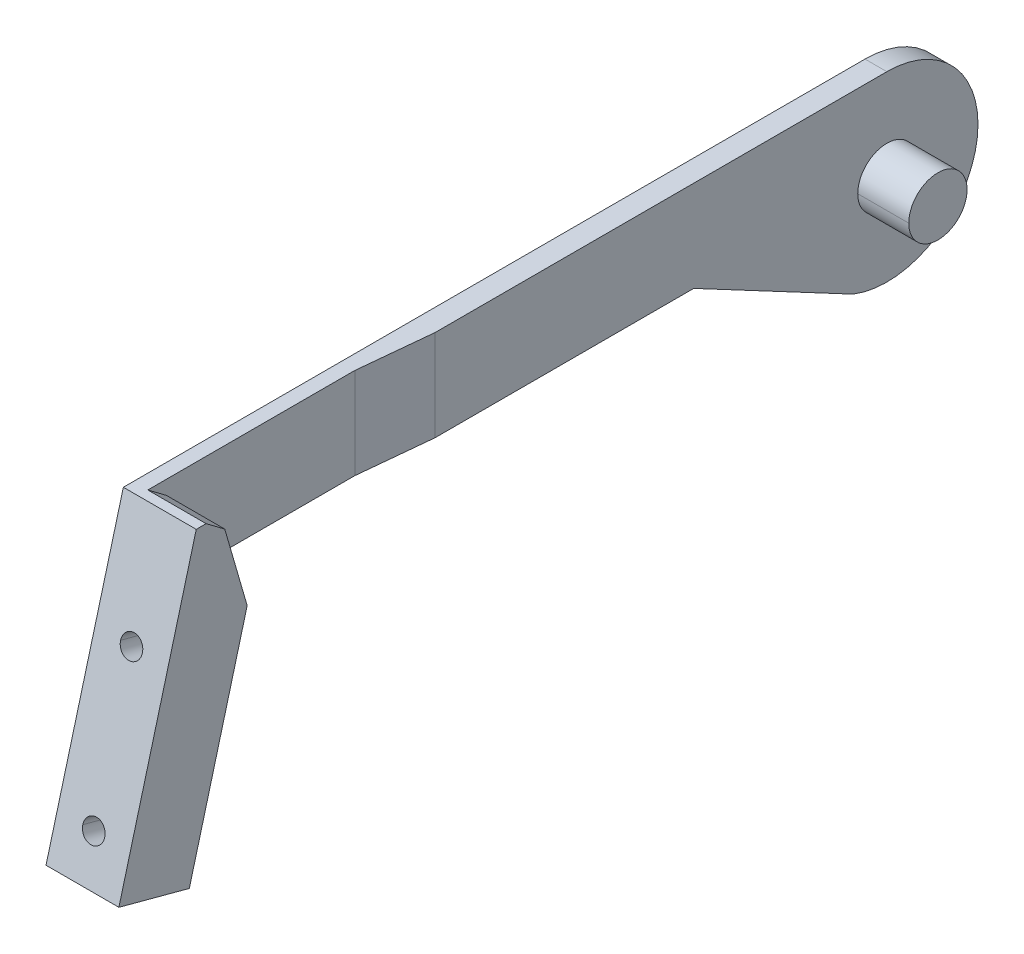
ISO-10303-21;
HEADER;
FILE_DESCRIPTION(('STEP AP214'),'2;1');
FILE_NAME('part.step','',(''),(''),'','','');
FILE_SCHEMA(('AUTOMOTIVE_DESIGN { 1 0 10303 214 1 1 1 1 }'));
ENDSEC;
DATA;
#1=APPLICATION_CONTEXT('core data for automotive mechanical design processes');
#2=APPLICATION_PROTOCOL_DEFINITION('international standard','automotive_design',2000,#1);
#3=PRODUCT_CONTEXT('',#1,'mechanical');
#4=PRODUCT('Part','Part','',(#3));
#5=PRODUCT_RELATED_PRODUCT_CATEGORY('part','',(#4));
#6=PRODUCT_DEFINITION_FORMATION('','',#4);
#7=PRODUCT_DEFINITION_CONTEXT('part definition',#1,'design');
#8=PRODUCT_DEFINITION('design','',#6,#7);
#9=PRODUCT_DEFINITION_SHAPE('','',#8);
#10=(LENGTH_UNIT() NAMED_UNIT(*) SI_UNIT(.MILLI.,.METRE.));
#11=(NAMED_UNIT(*) PLANE_ANGLE_UNIT() SI_UNIT($,.RADIAN.));
#12=(NAMED_UNIT(*) SI_UNIT($,.STERADIAN.) SOLID_ANGLE_UNIT());
#13=UNCERTAINTY_MEASURE_WITH_UNIT(LENGTH_MEASURE(1.E-05),#10,'distance_accuracy_value','');
#14=(GEOMETRIC_REPRESENTATION_CONTEXT(3) GLOBAL_UNCERTAINTY_ASSIGNED_CONTEXT((#13)) GLOBAL_UNIT_ASSIGNED_CONTEXT((#10,
#11,#12)) REPRESENTATION_CONTEXT('',''));
#15=CARTESIAN_POINT('',(0.,0.,0.));
#16=DIRECTION('',(0.,0.,1.));
#17=DIRECTION('',(1.,0.,0.));
#18=AXIS2_PLACEMENT_3D('',#15,#16,#17);
#19=CARTESIAN_POINT('',(-112.386906433293,211.674019092096,35.7842141653933));
#20=DIRECTION('',(-1.,0.,0.));
#21=DIRECTION('',(0.,0.,1.));
#22=AXIS2_PLACEMENT_3D('',#19,#20,#21);
#23=CYLINDRICAL_SURFACE('',#22,4.);
#24=CARTESIAN_POINT('',(-112.386906433293,211.674019092096,35.7842141653933));
#25=DIRECTION('',(1.,0.,0.));
#26=DIRECTION('',(0.,0.,-1.));
#27=AXIS2_PLACEMENT_3D('',#24,#25,#26);
#28=CIRCLE('',#27,4.);
#29=CARTESIAN_POINT('',(-112.386906433293,211.674019092096,31.7842141653933));
#30=VERTEX_POINT('',#29);
#31=CARTESIAN_POINT('',(-112.386906433293,211.674019092096,39.7842141653933));
#32=VERTEX_POINT('',#31);
#33=EDGE_CURVE('E276',#30,#32,#28,.T.);
#34=ORIENTED_EDGE('',*,*,#33,.F.);
#35=DIRECTION('',(-1.,0.,0.));
#36=VECTOR('',#35,1.);
#37=CARTESIAN_POINT('',(-112.386906433293,211.674019092096,31.7842141653933));
#38=LINE('',#37,#36);
#39=CARTESIAN_POINT('',(-119.386906433293,211.674019092096,31.7842141653934));
#40=VERTEX_POINT('',#39);
#41=EDGE_CURVE('E465',#30,#40,#38,.T.);
#42=ORIENTED_EDGE('',*,*,#41,.T.);
#43=CARTESIAN_POINT('',(-119.386906433293,211.674019092096,35.7842141653934));
#44=DIRECTION('',(1.,0.,0.));
#45=DIRECTION('',(0.,0.,-1.));
#46=AXIS2_PLACEMENT_3D('',#43,#44,#45);
#47=CIRCLE('',#46,4.);
#48=CARTESIAN_POINT('',(-119.386906433293,211.674019092096,39.7842141653934));
#49=VERTEX_POINT('',#48);
#50=EDGE_CURVE('E231',#40,#49,#47,.T.);
#51=ORIENTED_EDGE('',*,*,#50,.T.);
#52=DIRECTION('',(-1.,0.,0.));
#53=VECTOR('',#52,1.);
#54=CARTESIAN_POINT('',(-112.386906433293,211.674019092096,39.7842141653933));
#55=LINE('',#54,#53);
#56=EDGE_CURVE('E216',#32,#49,#55,.T.);
#57=ORIENTED_EDGE('',*,*,#56,.F.);
#58=EDGE_LOOP('',(#34,#42,#51,#57));
#59=FACE_BOUND('',#58,.T.);
#60=ADVANCED_FACE('F15',(#59),#23,.T.);
#61=CARTESIAN_POINT('',(-117.386906433294,209.685131697759,141.412633759828));
#62=DIRECTION('',(0.,-0.258819045102503,-0.965925826289073));
#63=DIRECTION('',(1.,0.,0.));
#64=AXIS2_PLACEMENT_3D('',#61,#62,#63);
#65=CYLINDRICAL_SURFACE('',#64,1.5);
#66=CARTESIAN_POINT('',(-117.386906433294,209.685131697759,141.412633759828));
#67=DIRECTION('',(0.,-0.258819045102506,-0.965925826289072));
#68=DIRECTION('',(1.,0.,0.));
#69=AXIS2_PLACEMENT_3D('',#66,#67,#68);
#70=CIRCLE('',#69,1.5);
#71=CARTESIAN_POINT('',(-118.886906433294,209.685131697759,141.412633759828));
#72=VERTEX_POINT('',#71);
#73=CARTESIAN_POINT('',(-115.886906433294,209.685131697759,141.412633759828));
#74=VERTEX_POINT('',#73);
#75=EDGE_CURVE('E255',#72,#74,#70,.T.);
#76=ORIENTED_EDGE('',*,*,#75,.F.);
#77=DIRECTION('',(0.,-0.258819045102503,-0.965925826289073));
#78=VECTOR('',#77,1.);
#79=CARTESIAN_POINT('',(-118.886906433294,209.685131697759,141.412633759828));
#80=LINE('',#79,#78);
#81=CARTESIAN_POINT('',(-118.886906433294,207.096941246734,131.753375496936));
#82=VERTEX_POINT('',#81);
#83=EDGE_CURVE('E187',#72,#82,#80,.T.);
#84=ORIENTED_EDGE('',*,*,#83,.T.);
#85=CARTESIAN_POINT('',(-117.386906433294,207.096941246734,131.753375496936));
#86=DIRECTION('',(0.,0.258819045102553,0.96592582628906));
#87=DIRECTION('',(1.,0.,0.));
#88=AXIS2_PLACEMENT_3D('',#85,#86,#87);
#89=CIRCLE('',#88,1.5);
#90=CARTESIAN_POINT('',(-115.886906433294,207.096941246734,131.753375496936));
#91=VERTEX_POINT('',#90);
#92=EDGE_CURVE('E238',#91,#82,#89,.T.);
#93=ORIENTED_EDGE('',*,*,#92,.F.);
#94=DIRECTION('',(0.,-0.258819045102503,-0.965925826289073));
#95=VECTOR('',#94,1.);
#96=CARTESIAN_POINT('',(-115.886906433294,209.685131697759,141.412633759828));
#97=LINE('',#96,#95);
#98=EDGE_CURVE('E299',#74,#91,#97,.T.);
#99=ORIENTED_EDGE('',*,*,#98,.F.);
#100=EDGE_LOOP('',(#76,#84,#93,#99));
#101=FACE_BOUND('',#100,.T.);
#102=ADVANCED_FACE('F396',(#101),#65,.F.);
#103=CARTESIAN_POINT('',(-117.386906433293,190.366615171978,146.589014661879));
#104=DIRECTION('',(0.,-0.258819045102503,-0.965925826289073));
#105=DIRECTION('',(1.,0.,0.));
#106=AXIS2_PLACEMENT_3D('',#103,#104,#105);
#107=CYLINDRICAL_SURFACE('',#106,1.5);
#108=CARTESIAN_POINT('',(-117.386906433293,190.366615171978,146.589014661878));
#109=DIRECTION('',(0.,-0.258819045102506,-0.965925826289072));
#110=DIRECTION('',(1.,0.,0.));
#111=AXIS2_PLACEMENT_3D('',#108,#109,#110);
#112=CIRCLE('',#111,1.5);
#113=CARTESIAN_POINT('',(-118.886906433293,190.366615171978,146.589014661878));
#114=VERTEX_POINT('',#113);
#115=CARTESIAN_POINT('',(-115.886906433293,190.366615171978,146.589014661878));
#116=VERTEX_POINT('',#115);
#117=EDGE_CURVE('E256',#114,#116,#112,.T.);
#118=ORIENTED_EDGE('',*,*,#117,.F.);
#119=DIRECTION('',(0.,-0.258819045102503,-0.965925826289073));
#120=VECTOR('',#119,1.);
#121=CARTESIAN_POINT('',(-118.886906433293,190.366615171978,146.589014661879));
#122=LINE('',#121,#120);
#123=CARTESIAN_POINT('',(-118.886906433293,187.778424720953,136.929756398986));
#124=VERTEX_POINT('',#123);
#125=EDGE_CURVE('E266',#114,#124,#122,.T.);
#126=ORIENTED_EDGE('',*,*,#125,.T.);
#127=CARTESIAN_POINT('',(-117.386906433293,187.778424720952,136.929756398986));
#128=DIRECTION('',(0.,0.258819045102553,0.96592582628906));
#129=DIRECTION('',(1.,0.,0.));
#130=AXIS2_PLACEMENT_3D('',#127,#128,#129);
#131=CIRCLE('',#130,1.5);
#132=CARTESIAN_POINT('',(-115.886906433293,187.778424720953,136.929756398986));
#133=VERTEX_POINT('',#132);
#134=EDGE_CURVE('E244',#133,#124,#131,.T.);
#135=ORIENTED_EDGE('',*,*,#134,.F.);
#136=DIRECTION('',(0.,-0.258819045102503,-0.965925826289073));
#137=VECTOR('',#136,1.);
#138=CARTESIAN_POINT('',(-115.886906433293,190.366615171978,146.589014661879));
#139=LINE('',#138,#137);
#140=EDGE_CURVE('E261',#116,#133,#139,.T.);
#141=ORIENTED_EDGE('',*,*,#140,.F.);
#142=EDGE_LOOP('',(#118,#126,#135,#141));
#143=FACE_BOUND('',#142,.T.);
#144=ADVANCED_FACE('F377',(#143),#107,.F.);
#145=CARTESIAN_POINT('',(-119.386906433293,211.674019092097,35.784214165394));
#146=DIRECTION('',(-1.,0.,0.));
#147=DIRECTION('',(0.,0.,-1.));
#148=AXIS2_PLACEMENT_3D('',#145,#146,#147);
#149=CYLINDRICAL_SURFACE('',#148,12.5);
#150=CARTESIAN_POINT('',(-119.386906433293,211.674019092097,35.784214165394));
#151=DIRECTION('',(1.,0.,0.));
#152=DIRECTION('',(0.,0.,-1.));
#153=AXIS2_PLACEMENT_3D('',#150,#151,#152);
#154=CIRCLE('',#153,12.5);
#155=CARTESIAN_POINT('',(-119.386906433293,211.674019092097,23.284214165394));
#156=VERTEX_POINT('',#155);
#157=CARTESIAN_POINT('',(-119.386906433293,224.174019092097,35.7842141653937));
#158=VERTEX_POINT('',#157);
#159=EDGE_CURVE('E234',#156,#158,#154,.T.);
#160=ORIENTED_EDGE('',*,*,#159,.F.);
#161=DIRECTION('',(-1.,0.,0.));
#162=VECTOR('',#161,1.);
#163=CARTESIAN_POINT('',(-119.386906433293,211.674019092097,23.284214165394));
#164=LINE('',#163,#162);
#165=CARTESIAN_POINT('',(-122.386906433293,211.674019092097,23.2842141653941));
#166=VERTEX_POINT('',#165);
#167=EDGE_CURVE('E9',#156,#166,#164,.T.);
#168=ORIENTED_EDGE('',*,*,#167,.T.);
#169=CARTESIAN_POINT('',(-122.386906433293,211.674019092097,35.7842141653941));
#170=DIRECTION('',(1.,0.,0.));
#171=DIRECTION('',(0.,0.,-1.));
#172=AXIS2_PLACEMENT_3D('',#169,#170,#171);
#173=CIRCLE('',#172,12.5);
#174=CARTESIAN_POINT('',(-122.386906433293,224.174019092097,35.7842141653938));
#175=VERTEX_POINT('',#174);
#176=EDGE_CURVE('E321',#166,#175,#173,.T.);
#177=ORIENTED_EDGE('',*,*,#176,.T.);
#178=DIRECTION('',(-1.,0.,0.));
#179=VECTOR('',#178,1.);
#180=CARTESIAN_POINT('',(-119.386906433293,224.174019092097,35.7842141653937));
#181=LINE('',#180,#179);
#182=EDGE_CURVE('E249',#158,#175,#181,.T.);
#183=ORIENTED_EDGE('',*,*,#182,.F.);
#184=EDGE_LOOP('',(#160,#168,#177,#183));
#185=FACE_BOUND('',#184,.T.);
#186=ADVANCED_FACE('F651',(#185),#149,.T.);
#187=CARTESIAN_POINT('',(-119.386906433293,211.674019092097,35.784214165394));
#188=DIRECTION('',(-1.,0.,0.));
#189=DIRECTION('',(0.,0.,-1.));
#190=AXIS2_PLACEMENT_3D('',#187,#188,#189);
#191=CYLINDRICAL_SURFACE('',#190,12.5);
#192=ORIENTED_EDGE('',*,*,#167,.F.);
#193=CARTESIAN_POINT('',(-119.386906433293,211.674019092097,35.784214165394));
#194=DIRECTION('',(1.,0.,0.));
#195=DIRECTION('',(0.,0.,-1.));
#196=AXIS2_PLACEMENT_3D('',#193,#194,#195);
#197=CIRCLE('',#196,12.5);
#198=CARTESIAN_POINT('',(-119.386906433293,200.075122592861,40.4442141653944));
#199=VERTEX_POINT('',#198);
#200=EDGE_CURVE('E477',#199,#156,#197,.T.);
#201=ORIENTED_EDGE('',*,*,#200,.F.);
#202=DIRECTION('',(1.,0.,0.));
#203=VECTOR('',#202,1.);
#204=CARTESIAN_POINT('',(-119.386906433293,200.075122592861,40.4442141653944));
#205=LINE('',#204,#203);
#206=CARTESIAN_POINT('',(-122.386906433293,200.075122592861,40.4442141653944));
#207=VERTEX_POINT('',#206);
#208=EDGE_CURVE('E26',#207,#199,#205,.T.);
#209=ORIENTED_EDGE('',*,*,#208,.F.);
#210=CARTESIAN_POINT('',(-122.386906433293,211.674019092097,35.7842141653941));
#211=DIRECTION('',(1.,0.,0.));
#212=DIRECTION('',(0.,0.,-1.));
#213=AXIS2_PLACEMENT_3D('',#210,#211,#212);
#214=CIRCLE('',#213,12.5);
#215=EDGE_CURVE('E283',#207,#166,#214,.T.);
#216=ORIENTED_EDGE('',*,*,#215,.T.);
#217=EDGE_LOOP('',(#192,#201,#209,#216));
#218=FACE_BOUND('',#217,.T.);
#219=ADVANCED_FACE('F414',(#218),#191,.T.);
#220=CARTESIAN_POINT('',(-119.386906433293,205.874570842479,51.3642141653942));
#221=DIRECTION('',(0.,-0.883176086632772,0.469041575982366));
#222=DIRECTION('',(-1.,0.,0.));
#223=AXIS2_PLACEMENT_3D('',#220,#221,#222);
#224=PLANE('',#223);
#225=DIRECTION('',(0.,-0.469041575982366,-0.883176086632772));
#226=VECTOR('',#225,1.);
#227=CARTESIAN_POINT('',(-122.386906433293,213.382785094218,65.501714165394));
#228=LINE('',#227,#226);
#229=CARTESIAN_POINT('',(-122.386906433293,211.674019092098,62.2842141653941));
#230=VERTEX_POINT('',#229);
#231=EDGE_CURVE('E279',#230,#207,#228,.T.);
#232=ORIENTED_EDGE('',*,*,#231,.T.);
#233=ORIENTED_EDGE('',*,*,#208,.T.);
#234=DIRECTION('',(0.,0.469041575982366,0.883176086632772));
#235=VECTOR('',#234,1.);
#236=CARTESIAN_POINT('',(-119.386906433293,213.382785094217,65.501714165394));
#237=LINE('',#236,#235);
#238=CARTESIAN_POINT('',(-119.386906433293,211.674019092098,62.284214165394));
#239=VERTEX_POINT('',#238);
#240=EDGE_CURVE('E19',#199,#239,#237,.T.);
#241=ORIENTED_EDGE('',*,*,#240,.T.);
#242=DIRECTION('',(-1.,0.,0.));
#243=VECTOR('',#242,1.);
#244=CARTESIAN_POINT('',(-119.386906433293,211.674019092098,62.284214165394));
#245=LINE('',#244,#243);
#246=EDGE_CURVE('E292',#239,#230,#245,.T.);
#247=ORIENTED_EDGE('',*,*,#246,.T.);
#248=EDGE_LOOP('',(#232,#233,#241,#247));
#249=FACE_BOUND('',#248,.T.);
#250=ADVANCED_FACE('F410',(#249),#224,.T.);
#251=CARTESIAN_POINT('',(-119.386906433292,211.674019092098,84.5342141653941));
#252=DIRECTION('',(1.,0.,0.));
#253=DIRECTION('',(0.,0.,-1.));
#254=AXIS2_PLACEMENT_3D('',#251,#252,#253);
#255=PLANE('',#254);
#256=CARTESIAN_POINT('',(-119.386906433293,211.674019092096,35.7842141653934));
#257=DIRECTION('',(1.,0.,0.));
#258=DIRECTION('',(0.,0.,-1.));
#259=AXIS2_PLACEMENT_3D('',#256,#257,#258);
#260=CIRCLE('',#259,4.);
#261=EDGE_CURVE('E218',#49,#40,#260,.T.);
#262=ORIENTED_EDGE('',*,*,#261,.F.);
#263=ORIENTED_EDGE('',*,*,#50,.F.);
#264=EDGE_LOOP('',(#262,#263));
#265=FACE_BOUND('',#264,.T.);
#266=DIRECTION('',(0.,0.,-1.));
#267=VECTOR('',#266,1.);
#268=CARTESIAN_POINT('',(-119.386906433291,211.6740190921,145.784214165394));
#269=LINE('',#268,#267);
#270=CARTESIAN_POINT('',(-119.386906433292,211.674019092099,97.7842141653975));
#271=VERTEX_POINT('',#270);
#272=EDGE_CURVE('E295',#271,#239,#269,.T.);
#273=ORIENTED_EDGE('',*,*,#272,.T.);
#274=ORIENTED_EDGE('',*,*,#240,.F.);
#275=ORIENTED_EDGE('',*,*,#200,.T.);
#276=ORIENTED_EDGE('',*,*,#159,.T.);
#277=DIRECTION('',(0.,0.,1.));
#278=VECTOR('',#277,1.);
#279=CARTESIAN_POINT('',(-119.386906433293,224.174019092097,25.7842141653937));
#280=LINE('',#279,#278);
#281=CARTESIAN_POINT('',(-119.386906433292,224.174019092099,97.7842141653971));
#282=VERTEX_POINT('',#281);
#283=EDGE_CURVE('E245',#158,#282,#280,.T.);
#284=ORIENTED_EDGE('',*,*,#283,.T.);
#285=DIRECTION('',(0.,1.,0.));
#286=VECTOR('',#285,1.);
#287=CARTESIAN_POINT('',(-119.386906433292,217.924019092098,97.7842141653973));
#288=LINE('',#287,#286);
#289=EDGE_CURVE('E284',#271,#282,#288,.T.);
#290=ORIENTED_EDGE('',*,*,#289,.F.);
#291=EDGE_LOOP('',(#273,#274,#275,#276,#284,#290));
#292=FACE_BOUND('',#291,.T.);
#293=ADVANCED_FACE('F413',(#265,#292),#255,.T.);
#294=CARTESIAN_POINT('',(-119.886906433292,217.924019092098,102.784214165397));
#295=DIRECTION('',(0.995037190209991,0.,0.099503719020983));
#296=DIRECTION('',(0.,-1.,0.));
#297=AXIS2_PLACEMENT_3D('',#294,#295,#296);
#298=PLANE('',#297);
#299=DIRECTION('',(0.0995037190209828,0.,-0.995037190209991));
#300=VECTOR('',#299,1.);
#301=CARTESIAN_POINT('',(-116.691361878837,211.674019092098,70.8287686208413));
#302=LINE('',#301,#300);
#303=CARTESIAN_POINT('',(-120.386906433293,211.674019092098,107.784214165398));
#304=VERTEX_POINT('',#303);
#305=EDGE_CURVE('E287',#304,#271,#302,.T.);
#306=ORIENTED_EDGE('',*,*,#305,.T.);
#307=ORIENTED_EDGE('',*,*,#289,.T.);
#308=DIRECTION('',(-0.0995037190209828,0.,0.995037190209991));
#309=VECTOR('',#308,1.);
#310=CARTESIAN_POINT('',(-121.518094552103,224.174019092099,119.096095353514));
#311=LINE('',#310,#309);
#312=CARTESIAN_POINT('',(-120.386906433293,224.174019092097,107.784214165397));
#313=VERTEX_POINT('',#312);
#314=EDGE_CURVE('E250',#282,#313,#311,.T.);
#315=ORIENTED_EDGE('',*,*,#314,.T.);
#316=DIRECTION('',(0.,-1.,0.));
#317=VECTOR('',#316,1.);
#318=CARTESIAN_POINT('',(-120.386906433293,224.174019092097,107.784214165397));
#319=LINE('',#318,#317);
#320=EDGE_CURVE('E243',#313,#304,#319,.T.);
#321=ORIENTED_EDGE('',*,*,#320,.T.);
#322=EDGE_LOOP('',(#306,#307,#315,#321));
#323=FACE_BOUND('',#322,.T.);
#324=ADVANCED_FACE('F426',(#323),#298,.T.);
#325=CARTESIAN_POINT('',(-119.386906433293,211.674019092097,48.284214165394));
#326=DIRECTION('',(0.,-1.,0.));
#327=DIRECTION('',(-1.,0.,0.));
#328=AXIS2_PLACEMENT_3D('',#325,#326,#327);
#329=PLANE('',#328);
#330=DIRECTION('',(0.,0.,-1.));
#331=VECTOR('',#330,1.);
#332=CARTESIAN_POINT('',(-122.386906433293,211.674019092098,66.4092141653941));
#333=LINE('',#332,#331);
#334=CARTESIAN_POINT('',(-122.386906433292,211.6740190921,130.558746124124));
#335=VERTEX_POINT('',#334);
#336=EDGE_CURVE('E214',#335,#230,#333,.T.);
#337=ORIENTED_EDGE('',*,*,#336,.T.);
#338=ORIENTED_EDGE('',*,*,#246,.F.);
#339=ORIENTED_EDGE('',*,*,#272,.F.);
#340=ORIENTED_EDGE('',*,*,#305,.F.);
#341=DIRECTION('',(0.,0.,1.));
#342=VECTOR('',#341,1.);
#343=CARTESIAN_POINT('',(-120.386906433293,211.674019092098,81.2842141653958));
#344=LINE('',#343,#342);
#345=CARTESIAN_POINT('',(-120.386906433293,211.6740190921,130.558746124124));
#346=VERTEX_POINT('',#345);
#347=EDGE_CURVE('E240',#304,#346,#344,.T.);
#348=ORIENTED_EDGE('',*,*,#347,.T.);
#349=DIRECTION('',(-1.,0.,0.));
#350=VECTOR('',#349,1.);
#351=CARTESIAN_POINT('',(-119.636906433292,211.674019092099,130.558746124124));
#352=LINE('',#351,#350);
#353=EDGE_CURVE('E239',#346,#335,#352,.T.);
#354=ORIENTED_EDGE('',*,*,#353,.T.);
#355=EDGE_LOOP('',(#337,#338,#339,#340,#348,#354));
#356=FACE_BOUND('',#355,.T.);
#357=ADVANCED_FACE('F17',(#356),#329,.T.);
#358=CARTESIAN_POINT('',(-120.386906433293,224.365693501724,124.284214165397));
#359=DIRECTION('',(1.,0.,0.));
#360=DIRECTION('',(0.,0.,-1.));
#361=AXIS2_PLACEMENT_3D('',#358,#359,#360);
#362=PLANE('',#361);
#363=ORIENTED_EDGE('',*,*,#347,.F.);
#364=ORIENTED_EDGE('',*,*,#320,.F.);
#365=DIRECTION('',(0.,0.,-1.));
#366=VECTOR('',#365,1.);
#367=CARTESIAN_POINT('',(-120.386906433293,224.174019092099,130.034214165395));
#368=LINE('',#367,#366);
#369=CARTESIAN_POINT('',(-120.386906433293,224.1740190921,136.177586279186));
#370=VERTEX_POINT('',#369);
#371=EDGE_CURVE('E275',#370,#313,#368,.T.);
#372=ORIENTED_EDGE('',*,*,#371,.F.);
#373=DIRECTION('',(0.,0.600796224988207,0.799402211680653));
#374=VECTOR('',#373,1.);
#375=CARTESIAN_POINT('',(-120.386906433293,220.872272803947,131.784377441681));
#376=LINE('',#375,#374);
#377=CARTESIAN_POINT('',(-120.386906433293,222.252907768,133.621410695026));
#378=VERTEX_POINT('',#377);
#379=EDGE_CURVE('E271',#378,#370,#376,.T.);
#380=ORIENTED_EDGE('',*,*,#379,.F.);
#381=DIRECTION('',(0.,0.960555662049912,0.278087792079865));
#382=VECTOR('',#381,1.);
#383=CARTESIAN_POINT('',(-120.386906433293,219.801833140684,132.911806912275));
#384=LINE('',#383,#382);
#385=EDGE_CURVE('E235',#346,#378,#384,.T.);
#386=ORIENTED_EDGE('',*,*,#385,.F.);
#387=EDGE_LOOP('',(#363,#364,#372,#380,#386));
#388=FACE_BOUND('',#387,.T.);
#389=ADVANCED_FACE('F421',(#388),#362,.T.);
#390=CARTESIAN_POINT('',(-120.386906433295,182.174019092093,138.431452361295));
#391=DIRECTION('',(0.,0.258819045102553,0.96592582628906));
#392=DIRECTION('',(1.,0.,0.));
#393=AXIS2_PLACEMENT_3D('',#390,#391,#392);
#394=PLANE('',#393);
#395=ORIENTED_EDGE('',*,*,#134,.T.);
#396=CARTESIAN_POINT('',(-117.386906433293,187.778424720952,136.929756398986));
#397=DIRECTION('',(0.,0.258819045102553,0.96592582628906));
#398=DIRECTION('',(1.,0.,0.));
#399=AXIS2_PLACEMENT_3D('',#396,#397,#398);
#400=CIRCLE('',#399,1.5);
#401=EDGE_CURVE('E265',#124,#133,#400,.T.);
#402=ORIENTED_EDGE('',*,*,#401,.T.);
#403=EDGE_LOOP('',(#395,#402));
#404=FACE_BOUND('',#403,.T.);
#405=ORIENTED_EDGE('',*,*,#92,.T.);
#406=CARTESIAN_POINT('',(-117.386906433294,207.096941246734,131.753375496936));
#407=DIRECTION('',(0.,0.258819045102553,0.96592582628906));
#408=DIRECTION('',(1.,0.,0.));
#409=AXIS2_PLACEMENT_3D('',#406,#407,#408);
#410=CIRCLE('',#409,1.5);
#411=EDGE_CURVE('E303',#82,#91,#410,.T.);
#412=ORIENTED_EDGE('',*,*,#411,.T.);
#413=EDGE_LOOP('',(#405,#412));
#414=FACE_BOUND('',#413,.T.);
#415=DIRECTION('',(-1.,0.,0.));
#416=VECTOR('',#415,1.);
#417=CARTESIAN_POINT('',(-120.386906433295,181.982869763218,138.482670669601));
#418=LINE('',#417,#416);
#419=CARTESIAN_POINT('',(-112.386906433295,181.982869763218,138.4826706696));
#420=VERTEX_POINT('',#419);
#421=CARTESIAN_POINT('',(-122.386906433292,181.982869763218,138.4826706696));
#422=VERTEX_POINT('',#421);
#423=EDGE_CURVE('E288',#420,#422,#418,.T.);
#424=ORIENTED_EDGE('',*,*,#423,.T.);
#425=DIRECTION('',(0.,-0.96592582628906,0.258819045102553));
#426=VECTOR('',#425,1.);
#427=CARTESIAN_POINT('',(-122.386906433292,202.673111219494,132.938737180186));
#428=LINE('',#427,#426);
#429=CARTESIAN_POINT('',(-122.386906433292,211.616983350338,130.542233865519));
#430=VERTEX_POINT('',#429);
#431=EDGE_CURVE('E229',#430,#422,#428,.T.);
#432=ORIENTED_EDGE('',*,*,#431,.F.);
#433=DIRECTION('',(-1.,0.,0.));
#434=VECTOR('',#433,1.);
#435=CARTESIAN_POINT('',(-119.886906433293,211.616983350338,130.542233865519));
#436=LINE('',#435,#434);
#437=CARTESIAN_POINT('',(-112.386906433294,211.616983350338,130.542233865519));
#438=VERTEX_POINT('',#437);
#439=EDGE_CURVE('E334',#438,#430,#436,.T.);
#440=ORIENTED_EDGE('',*,*,#439,.F.);
#441=DIRECTION('',(0.,-0.965925826289057,0.258819045102562));
#442=VECTOR('',#441,1.);
#443=CARTESIAN_POINT('',(-112.386906433294,186.812498894663,137.188575444087));
#444=LINE('',#443,#442);
#445=EDGE_CURVE('E224',#438,#420,#444,.T.);
#446=ORIENTED_EDGE('',*,*,#445,.T.);
#447=EDGE_LOOP('',(#424,#432,#440,#446));
#448=FACE_BOUND('',#447,.T.);
#449=ADVANCED_FACE('F418',(#404,#414,#448),#394,.F.);
#450=CARTESIAN_POINT('',(-119.886906433293,217.895501221219,132.359910072352));
#451=DIRECTION('',(0.,0.278087792079866,-0.960555662049912));
#452=DIRECTION('',(-1.,0.,0.));
#453=AXIS2_PLACEMENT_3D('',#450,#451,#452);
#454=PLANE('',#453);
#455=DIRECTION('',(-1.,0.,0.));
#456=VECTOR('',#455,1.);
#457=CARTESIAN_POINT('',(-119.636906433292,222.252907768,133.621410695026));
#458=LINE('',#457,#456);
#459=CARTESIAN_POINT('',(-112.386906433294,222.252907768,133.621410695026));
#460=VERTEX_POINT('',#459);
#461=EDGE_CURVE('E267',#460,#378,#458,.T.);
#462=ORIENTED_EDGE('',*,*,#461,.F.);
#463=DIRECTION('',(0.,-0.960555662049912,-0.278087792079865));
#464=VECTOR('',#463,1.);
#465=CARTESIAN_POINT('',(-112.386906433294,212.79535546409,130.883381091347));
#466=LINE('',#465,#464);
#467=EDGE_CURVE('E221',#460,#438,#466,.T.);
#468=ORIENTED_EDGE('',*,*,#467,.T.);
#469=ORIENTED_EDGE('',*,*,#439,.T.);
#470=DIRECTION('',(0.,0.960555662049912,0.278087792079865));
#471=VECTOR('',#470,1.);
#472=CARTESIAN_POINT('',(-122.386906433292,208.637751208657,129.679724673074));
#473=LINE('',#472,#471);
#474=EDGE_CURVE('E226',#430,#335,#473,.T.);
#475=ORIENTED_EDGE('',*,*,#474,.T.);
#476=ORIENTED_EDGE('',*,*,#353,.F.);
#477=ORIENTED_EDGE('',*,*,#385,.T.);
#478=EDGE_LOOP('',(#462,#468,#469,#475,#476,#477));
#479=FACE_BOUND('',#478,.T.);
#480=ADVANCED_FACE('F409',(#479),#454,.T.);
#481=CARTESIAN_POINT('',(-119.386906433291,224.1740190921,145.784214165394));
#482=DIRECTION('',(0.,1.,0.));
#483=DIRECTION('',(0.,0.,-1.));
#484=AXIS2_PLACEMENT_3D('',#481,#482,#483);
#485=PLANE('',#484);
#486=DIRECTION('',(1.,0.,0.));
#487=VECTOR('',#486,1.);
#488=CARTESIAN_POINT('',(-119.636906433292,224.1740190921,136.177586279186));
#489=LINE('',#488,#487);
#490=CARTESIAN_POINT('',(-112.386906433294,224.174019092096,136.177586279186));
#491=VERTEX_POINT('',#490);
#492=EDGE_CURVE('E313',#370,#491,#489,.T.);
#493=ORIENTED_EDGE('',*,*,#492,.F.);
#494=ORIENTED_EDGE('',*,*,#371,.T.);
#495=ORIENTED_EDGE('',*,*,#314,.F.);
#496=ORIENTED_EDGE('',*,*,#283,.F.);
#497=ORIENTED_EDGE('',*,*,#182,.T.);
#498=DIRECTION('',(0.,0.,-1.));
#499=VECTOR('',#498,1.);
#500=CARTESIAN_POINT('',(-122.386906433292,224.174019092093,112.659214165395));
#501=LINE('',#500,#499);
#502=CARTESIAN_POINT('',(-122.386906433291,224.174019092093,137.530348083289));
#503=VERTEX_POINT('',#502);
#504=EDGE_CURVE('E193',#503,#175,#501,.T.);
#505=ORIENTED_EDGE('',*,*,#504,.F.);
#506=DIRECTION('',(1.,0.,0.));
#507=VECTOR('',#506,1.);
#508=CARTESIAN_POINT('',(-120.386906433294,224.174019092097,137.530348083286));
#509=LINE('',#508,#507);
#510=CARTESIAN_POINT('',(-112.386906433294,224.174019092097,137.530348083286));
#511=VERTEX_POINT('',#510);
#512=EDGE_CURVE('E190',#503,#511,#509,.T.);
#513=ORIENTED_EDGE('',*,*,#512,.T.);
#514=DIRECTION('',(0.,1.04649593857805E-13,1.));
#515=VECTOR('',#514,1.);
#516=CARTESIAN_POINT('',(-112.386906433295,224.174019092094,107.784214165399));
#517=LINE('',#516,#515);
#518=EDGE_CURVE('E174',#491,#511,#517,.T.);
#519=ORIENTED_EDGE('',*,*,#518,.F.);
#520=EDGE_LOOP('',(#493,#494,#495,#496,#497,#505,#513,#519));
#521=FACE_BOUND('',#520,.T.);
#522=ADVANCED_FACE('F191',(#521),#485,.T.);
#523=CARTESIAN_POINT('',(-119.636906433292,223.21346343005,134.899498487106));
#524=DIRECTION('',(0.,0.799402211680653,-0.600796224988207));
#525=DIRECTION('',(-1.,0.,0.));
#526=AXIS2_PLACEMENT_3D('',#523,#524,#525);
#527=PLANE('',#526);
#528=DIRECTION('',(0.,-0.600796224988207,-0.799402211680653));
#529=VECTOR('',#528,1.);
#530=CARTESIAN_POINT('',(-112.386906433294,220.522819771925,131.319405267993));
#531=LINE('',#530,#529);
#532=EDGE_CURVE('E183',#491,#460,#531,.T.);
#533=ORIENTED_EDGE('',*,*,#532,.T.);
#534=ORIENTED_EDGE('',*,*,#461,.T.);
#535=ORIENTED_EDGE('',*,*,#379,.T.);
#536=ORIENTED_EDGE('',*,*,#492,.T.);
#537=EDGE_LOOP('',(#533,#534,#535,#536));
#538=FACE_BOUND('',#537,.T.);
#539=ADVANCED_FACE('F351',(#538),#527,.T.);
#540=CARTESIAN_POINT('',(-117.386906433293,190.366615171978,146.589014661879));
#541=DIRECTION('',(0.,-0.258819045102503,-0.965925826289073));
#542=DIRECTION('',(1.,0.,0.));
#543=AXIS2_PLACEMENT_3D('',#540,#541,#542);
#544=CYLINDRICAL_SURFACE('',#543,1.5);
#545=ORIENTED_EDGE('',*,*,#125,.F.);
#546=CARTESIAN_POINT('',(-117.386906433293,190.366615171978,146.589014661878));
#547=DIRECTION('',(0.,-0.258819045102506,-0.965925826289072));
#548=DIRECTION('',(1.,0.,0.));
#549=AXIS2_PLACEMENT_3D('',#546,#547,#548);
#550=CIRCLE('',#549,1.5);
#551=EDGE_CURVE('E198',#116,#114,#550,.T.);
#552=ORIENTED_EDGE('',*,*,#551,.F.);
#553=ORIENTED_EDGE('',*,*,#140,.T.);
#554=ORIENTED_EDGE('',*,*,#401,.F.);
#555=EDGE_LOOP('',(#545,#552,#553,#554));
#556=FACE_BOUND('',#555,.T.);
#557=ADVANCED_FACE('F372',(#556),#544,.F.);
#558=CARTESIAN_POINT('',(-117.386906433294,209.685131697759,141.412633759828));
#559=DIRECTION('',(0.,-0.258819045102503,-0.965925826289073));
#560=DIRECTION('',(1.,0.,0.));
#561=AXIS2_PLACEMENT_3D('',#558,#559,#560);
#562=CYLINDRICAL_SURFACE('',#561,1.5);
#563=ORIENTED_EDGE('',*,*,#83,.F.);
#564=CARTESIAN_POINT('',(-117.386906433294,209.685131697759,141.412633759828));
#565=DIRECTION('',(0.,-0.258819045102506,-0.965925826289072));
#566=DIRECTION('',(1.,0.,0.));
#567=AXIS2_PLACEMENT_3D('',#564,#565,#566);
#568=CIRCLE('',#567,1.5);
#569=EDGE_CURVE('E251',#74,#72,#568,.T.);
#570=ORIENTED_EDGE('',*,*,#569,.F.);
#571=ORIENTED_EDGE('',*,*,#98,.T.);
#572=ORIENTED_EDGE('',*,*,#411,.F.);
#573=EDGE_LOOP('',(#563,#570,#571,#572));
#574=FACE_BOUND('',#573,.T.);
#575=ADVANCED_FACE('F391',(#574),#562,.F.);
#576=CARTESIAN_POINT('',(-112.386906433294,205.49325899338,137.012709993084));
#577=DIRECTION('',(1.,0.,0.));
#578=DIRECTION('',(0.,0.,-1.));
#579=AXIS2_PLACEMENT_3D('',#576,#577,#578);
#580=PLANE('',#579);
#581=DIRECTION('',(0.,-0.258819045102562,-0.965925826289057));
#582=VECTOR('',#581,1.);
#583=CARTESIAN_POINT('',(-112.386906433294,183.880668630162,145.565352463582));
#584=LINE('',#583,#582);
#585=CARTESIAN_POINT('',(-112.386906433294,184.571060214244,148.141928932495));
#586=VERTEX_POINT('',#585);
#587=EDGE_CURVE('E210',#586,#420,#584,.T.);
#588=ORIENTED_EDGE('',*,*,#587,.T.);
#589=ORIENTED_EDGE('',*,*,#445,.F.);
#590=ORIENTED_EDGE('',*,*,#467,.F.);
#591=ORIENTED_EDGE('',*,*,#532,.F.);
#592=ORIENTED_EDGE('',*,*,#518,.T.);
#593=DIRECTION('',(0.,-0.965925826289057,0.258819045102564));
#594=VECTOR('',#593,1.);
#595=CARTESIAN_POINT('',(-112.386906433294,182.174019092097,148.784214165395));
#596=LINE('',#595,#594);
#597=EDGE_CURVE('E179',#511,#586,#596,.T.);
#598=ORIENTED_EDGE('',*,*,#597,.T.);
#599=EDGE_LOOP('',(#588,#589,#590,#591,#592,#598));
#600=FACE_BOUND('',#599,.T.);
#601=ADVANCED_FACE('F177',(#600),#580,.T.);
#602=CARTESIAN_POINT('',(-119.386906433291,203.174019092096,143.157281124343));
#603=DIRECTION('',(0.,0.258819045102506,0.965925826289072));
#604=DIRECTION('',(1.,0.,0.));
#605=AXIS2_PLACEMENT_3D('',#602,#603,#604);
#606=PLANE('',#605);
#607=ORIENTED_EDGE('',*,*,#569,.T.);
#608=ORIENTED_EDGE('',*,*,#75,.T.);
#609=EDGE_LOOP('',(#607,#608));
#610=FACE_BOUND('',#609,.T.);
#611=ORIENTED_EDGE('',*,*,#551,.T.);
#612=ORIENTED_EDGE('',*,*,#117,.T.);
#613=EDGE_LOOP('',(#611,#612));
#614=FACE_BOUND('',#613,.T.);
#615=DIRECTION('',(1.,0.,0.));
#616=VECTOR('',#615,1.);
#617=CARTESIAN_POINT('',(-119.886906433293,184.571060214244,148.141928932493));
#618=LINE('',#617,#616);
#619=CARTESIAN_POINT('',(-122.386906433292,184.571060214244,148.141928932493));
#620=VERTEX_POINT('',#619);
#621=EDGE_CURVE('E201',#620,#586,#618,.T.);
#622=ORIENTED_EDGE('',*,*,#621,.T.);
#623=ORIENTED_EDGE('',*,*,#597,.F.);
#624=ORIENTED_EDGE('',*,*,#512,.F.);
#625=DIRECTION('',(0.,-0.965925826289072,0.258819045102506));
#626=VECTOR('',#625,1.);
#627=CARTESIAN_POINT('',(-122.386906433291,214.467206445007,140.131280693157));
#628=LINE('',#627,#626);
#629=EDGE_CURVE('E257',#503,#620,#628,.T.);
#630=ORIENTED_EDGE('',*,*,#629,.T.);
#631=EDGE_LOOP('',(#622,#623,#624,#630));
#632=FACE_BOUND('',#631,.T.);
#633=ADVANCED_FACE('F200',(#610,#614,#632),#606,.T.);
#634=CARTESIAN_POINT('',(-120.386906433294,184.571060214244,148.141928932495));
#635=DIRECTION('',(0.,0.965925826289057,-0.258819045102562));
#636=DIRECTION('',(-1.,0.,0.));
#637=AXIS2_PLACEMENT_3D('',#634,#635,#636);
#638=PLANE('',#637);
#639=DIRECTION('',(0.,0.258819045102562,0.965925826289057));
#640=VECTOR('',#639,1.);
#641=CARTESIAN_POINT('',(-122.386906433292,177.527872861333,121.856395884207));
#642=LINE('',#641,#640);
#643=EDGE_CURVE('E260',#422,#620,#642,.T.);
#644=ORIENTED_EDGE('',*,*,#643,.F.);
#645=ORIENTED_EDGE('',*,*,#423,.F.);
#646=ORIENTED_EDGE('',*,*,#587,.F.);
#647=ORIENTED_EDGE('',*,*,#621,.F.);
#648=EDGE_LOOP('',(#644,#645,#646,#647));
#649=FACE_BOUND('',#648,.T.);
#650=ADVANCED_FACE('F380',(#649),#638,.F.);
#651=CARTESIAN_POINT('',(-122.386906433292,211.674019092098,84.5342141653941));
#652=DIRECTION('',(1.,0.,0.));
#653=DIRECTION('',(0.,0.,-1.));
#654=AXIS2_PLACEMENT_3D('',#651,#652,#653);
#655=PLANE('',#654);
#656=ORIENTED_EDGE('',*,*,#643,.T.);
#657=ORIENTED_EDGE('',*,*,#629,.F.);
#658=ORIENTED_EDGE('',*,*,#504,.T.);
#659=ORIENTED_EDGE('',*,*,#176,.F.);
#660=ORIENTED_EDGE('',*,*,#215,.F.);
#661=ORIENTED_EDGE('',*,*,#231,.F.);
#662=ORIENTED_EDGE('',*,*,#336,.F.);
#663=ORIENTED_EDGE('',*,*,#474,.F.);
#664=ORIENTED_EDGE('',*,*,#431,.T.);
#665=EDGE_LOOP('',(#656,#657,#658,#659,#660,#661,#662,#663,#664));
#666=FACE_BOUND('',#665,.T.);
#667=ADVANCED_FACE('F388',(#666),#655,.F.);
#668=CARTESIAN_POINT('',(-112.386906433293,211.674019092096,35.7842141653933));
#669=DIRECTION('',(1.,0.,0.));
#670=DIRECTION('',(0.,0.,-1.));
#671=AXIS2_PLACEMENT_3D('',#668,#669,#670);
#672=PLANE('',#671);
#673=CARTESIAN_POINT('',(-112.386906433293,211.674019092096,35.7842141653933));
#674=DIRECTION('',(1.,0.,0.));
#675=DIRECTION('',(0.,0.,-1.));
#676=AXIS2_PLACEMENT_3D('',#673,#674,#675);
#677=CIRCLE('',#676,4.);
#678=EDGE_CURVE('E219',#32,#30,#677,.T.);
#679=ORIENTED_EDGE('',*,*,#678,.T.);
#680=ORIENTED_EDGE('',*,*,#33,.T.);
#681=EDGE_LOOP('',(#679,#680));
#682=FACE_BOUND('',#681,.T.);
#683=ADVANCED_FACE('F432',(#682),#672,.T.);
#684=CARTESIAN_POINT('',(-112.386906433293,211.674019092096,35.7842141653933));
#685=DIRECTION('',(-1.,0.,0.));
#686=DIRECTION('',(0.,0.,1.));
#687=AXIS2_PLACEMENT_3D('',#684,#685,#686);
#688=CYLINDRICAL_SURFACE('',#687,4.);
#689=ORIENTED_EDGE('',*,*,#41,.F.);
#690=ORIENTED_EDGE('',*,*,#678,.F.);
#691=ORIENTED_EDGE('',*,*,#56,.T.);
#692=ORIENTED_EDGE('',*,*,#261,.T.);
#693=EDGE_LOOP('',(#689,#690,#691,#692));
#694=FACE_BOUND('',#693,.T.);
#695=ADVANCED_FACE('F435',(#694),#688,.T.);
#696=CLOSED_SHELL('',(#60,#102,#144,#186,#219,#250,#293,#324,#357,#389,#449,#480,#522,#539,#557,
#575,#601,#633,#650,#667,#683,#695));
#697=MANIFOLD_SOLID_BREP('B1',#696);
#698=ADVANCED_BREP_SHAPE_REPRESENTATION('',(#18,#697),#14);
#699=SHAPE_DEFINITION_REPRESENTATION(#9,#698);
ENDSEC;
END-ISO-10303-21;
